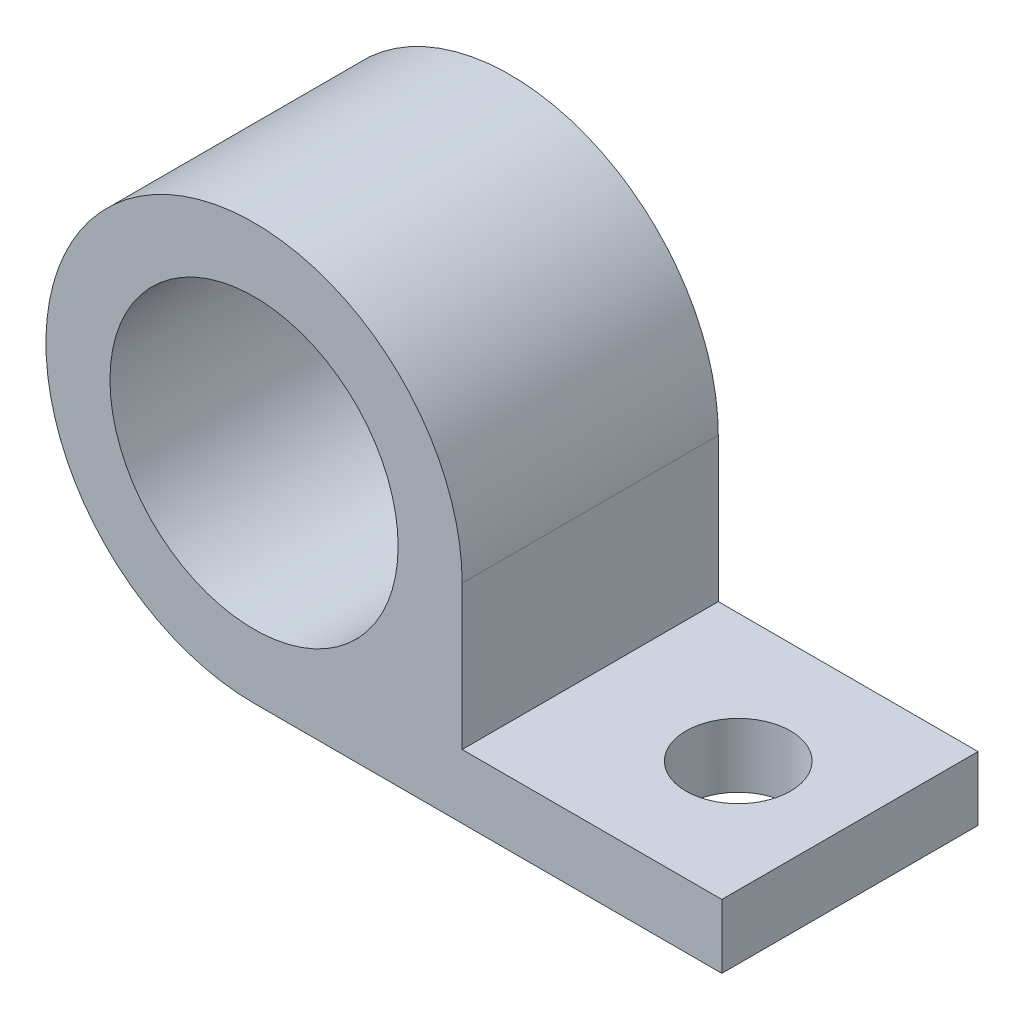
ISO-10303-21;
HEADER;
FILE_DESCRIPTION(('STEP AP214'),'2;1');
FILE_NAME('part.step','',(''),(''),'','','');
FILE_SCHEMA(('AUTOMOTIVE_DESIGN { 1 0 10303 214 1 1 1 1 }'));
ENDSEC;
DATA;
#1=APPLICATION_CONTEXT('core data for automotive mechanical design processes');
#2=APPLICATION_PROTOCOL_DEFINITION('international standard','automotive_design',2000,#1);
#3=PRODUCT_CONTEXT('',#1,'mechanical');
#4=PRODUCT('Part','Part','',(#3));
#5=PRODUCT_RELATED_PRODUCT_CATEGORY('part','',(#4));
#6=PRODUCT_DEFINITION_FORMATION('','',#4);
#7=PRODUCT_DEFINITION_CONTEXT('part definition',#1,'design');
#8=PRODUCT_DEFINITION('design','',#6,#7);
#9=PRODUCT_DEFINITION_SHAPE('','',#8);
#10=(LENGTH_UNIT() NAMED_UNIT(*) SI_UNIT(.MILLI.,.METRE.));
#11=(NAMED_UNIT(*) PLANE_ANGLE_UNIT() SI_UNIT($,.RADIAN.));
#12=(NAMED_UNIT(*) SI_UNIT($,.STERADIAN.) SOLID_ANGLE_UNIT());
#13=UNCERTAINTY_MEASURE_WITH_UNIT(LENGTH_MEASURE(1.E-05),#10,'distance_accuracy_value','');
#14=(GEOMETRIC_REPRESENTATION_CONTEXT(3) GLOBAL_UNCERTAINTY_ASSIGNED_CONTEXT((#13)) GLOBAL_UNIT_ASSIGNED_CONTEXT((#10,
#11,#12)) REPRESENTATION_CONTEXT('',''));
#15=CARTESIAN_POINT('',(0.,0.,0.));
#16=DIRECTION('',(0.,0.,1.));
#17=DIRECTION('',(1.,0.,0.));
#18=AXIS2_PLACEMENT_3D('',#15,#16,#17);
#19=CARTESIAN_POINT('',(0.,0.,6.35));
#20=DIRECTION('',(0.,0.,1.));
#21=DIRECTION('',(1.,0.,0.));
#22=AXIS2_PLACEMENT_3D('',#19,#20,#21);
#23=PLANE('',#22);
#24=CARTESIAN_POINT('',(0.,0.,6.35));
#25=DIRECTION('',(0.,0.,1.));
#26=DIRECTION('',(1.,0.,0.));
#27=AXIS2_PLACEMENT_3D('',#24,#25,#26);
#28=CIRCLE('',#27,10.31875);
#29=CARTESIAN_POINT('',(10.31875,0.,6.35));
#30=VERTEX_POINT('',#29);
#31=CARTESIAN_POINT('',(0.,-10.31875,6.35));
#32=VERTEX_POINT('',#31);
#33=EDGE_CURVE('E118',#30,#32,#28,.T.);
#34=ORIENTED_EDGE('',*,*,#33,.T.);
#35=DIRECTION('',(1.,0.,0.));
#36=VECTOR('',#35,1.);
#37=CARTESIAN_POINT('',(0.,-10.31875,6.35));
#38=LINE('',#37,#36);
#39=CARTESIAN_POINT('',(23.19528,-10.31875,6.35));
#40=VERTEX_POINT('',#39);
#41=EDGE_CURVE('E85',#32,#40,#38,.T.);
#42=ORIENTED_EDGE('',*,*,#41,.T.);
#43=DIRECTION('',(0.,1.,0.));
#44=VECTOR('',#43,1.);
#45=CARTESIAN_POINT('',(23.19528,-10.31875,6.35));
#46=LINE('',#45,#44);
#47=CARTESIAN_POINT('',(23.19528,-7.14374999999999,6.35));
#48=VERTEX_POINT('',#47);
#49=EDGE_CURVE('E89',#40,#48,#46,.T.);
#50=ORIENTED_EDGE('',*,*,#49,.T.);
#51=DIRECTION('',(-1.,0.,0.));
#52=VECTOR('',#51,1.);
#53=CARTESIAN_POINT('',(23.19528,-7.14374999999999,6.35));
#54=LINE('',#53,#52);
#55=CARTESIAN_POINT('',(10.31875,-7.14375,6.35));
#56=VERTEX_POINT('',#55);
#57=EDGE_CURVE('E93',#48,#56,#54,.T.);
#58=ORIENTED_EDGE('',*,*,#57,.T.);
#59=DIRECTION('',(0.,1.,0.));
#60=VECTOR('',#59,1.);
#61=CARTESIAN_POINT('',(10.31875,-7.14375,6.35));
#62=LINE('',#61,#60);
#63=EDGE_CURVE('E51',#56,#30,#62,.T.);
#64=ORIENTED_EDGE('',*,*,#63,.T.);
#65=EDGE_LOOP('',(#34,#42,#50,#58,#64));
#66=FACE_BOUND('',#65,.T.);
#67=CARTESIAN_POINT('',(0.,0.,6.35));
#68=DIRECTION('',(0.,0.,1.));
#69=DIRECTION('',(1.,0.,0.));
#70=AXIS2_PLACEMENT_3D('',#67,#68,#69);
#71=CIRCLE('',#70,7.14375);
#72=CARTESIAN_POINT('',(7.14375,0.,6.35));
#73=VERTEX_POINT('',#72);
#74=EDGE_CURVE('E113',#73,#73,#71,.T.);
#75=ORIENTED_EDGE('',*,*,#74,.F.);
#76=EDGE_LOOP('',(#75));
#77=FACE_BOUND('',#76,.T.);
#78=ADVANCED_FACE('F33',(#66,#77),#23,.T.);
#79=CARTESIAN_POINT('',(0.,0.,-6.35));
#80=DIRECTION('',(0.,0.,1.));
#81=DIRECTION('',(1.,0.,0.));
#82=AXIS2_PLACEMENT_3D('',#79,#80,#81);
#83=PLANE('',#82);
#84=CARTESIAN_POINT('',(0.,0.,-6.35));
#85=DIRECTION('',(0.,0.,1.));
#86=DIRECTION('',(1.,0.,0.));
#87=AXIS2_PLACEMENT_3D('',#84,#85,#86);
#88=CIRCLE('',#87,10.31875);
#89=CARTESIAN_POINT('',(10.31875,0.,-6.35));
#90=VERTEX_POINT('',#89);
#91=CARTESIAN_POINT('',(0.,-10.31875,-6.35));
#92=VERTEX_POINT('',#91);
#93=EDGE_CURVE('E109',#90,#92,#88,.T.);
#94=ORIENTED_EDGE('',*,*,#93,.F.);
#95=DIRECTION('',(0.,1.,0.));
#96=VECTOR('',#95,1.);
#97=CARTESIAN_POINT('',(10.31875,-7.14375,-6.35));
#98=LINE('',#97,#96);
#99=CARTESIAN_POINT('',(10.31875,-7.14375,-6.35));
#100=VERTEX_POINT('',#99);
#101=EDGE_CURVE('E77',#100,#90,#98,.T.);
#102=ORIENTED_EDGE('',*,*,#101,.F.);
#103=DIRECTION('',(-1.,0.,0.));
#104=VECTOR('',#103,1.);
#105=CARTESIAN_POINT('',(23.19528,-7.14374999999999,-6.35));
#106=LINE('',#105,#104);
#107=CARTESIAN_POINT('',(23.19528,-7.14374999999999,-6.35));
#108=VERTEX_POINT('',#107);
#109=EDGE_CURVE('E71',#108,#100,#106,.T.);
#110=ORIENTED_EDGE('',*,*,#109,.F.);
#111=DIRECTION('',(0.,1.,0.));
#112=VECTOR('',#111,1.);
#113=CARTESIAN_POINT('',(23.19528,-10.31875,-6.35));
#114=LINE('',#113,#112);
#115=CARTESIAN_POINT('',(23.19528,-10.31875,-6.35));
#116=VERTEX_POINT('',#115);
#117=EDGE_CURVE('E100',#116,#108,#114,.T.);
#118=ORIENTED_EDGE('',*,*,#117,.F.);
#119=DIRECTION('',(1.,0.,0.));
#120=VECTOR('',#119,1.);
#121=CARTESIAN_POINT('',(0.,-10.31875,-6.35));
#122=LINE('',#121,#120);
#123=EDGE_CURVE('E112',#92,#116,#122,.T.);
#124=ORIENTED_EDGE('',*,*,#123,.F.);
#125=EDGE_LOOP('',(#94,#102,#110,#118,#124));
#126=FACE_BOUND('',#125,.T.);
#127=CARTESIAN_POINT('',(0.,0.,-6.35));
#128=DIRECTION('',(0.,0.,1.));
#129=DIRECTION('',(1.,0.,0.));
#130=AXIS2_PLACEMENT_3D('',#127,#128,#129);
#131=CIRCLE('',#130,7.14375);
#132=CARTESIAN_POINT('',(7.14375,0.,-6.35));
#133=VERTEX_POINT('',#132);
#134=EDGE_CURVE('E158',#133,#133,#131,.T.);
#135=ORIENTED_EDGE('',*,*,#134,.T.);
#136=EDGE_LOOP('',(#135));
#137=FACE_BOUND('',#136,.T.);
#138=ADVANCED_FACE('F123',(#126,#137),#83,.F.);
#139=CARTESIAN_POINT('',(0.,0.,6.35));
#140=DIRECTION('',(0.,0.,-1.));
#141=DIRECTION('',(-1.,0.,0.));
#142=AXIS2_PLACEMENT_3D('',#139,#140,#141);
#143=CYLINDRICAL_SURFACE('',#142,10.31875);
#144=ORIENTED_EDGE('',*,*,#93,.T.);
#145=DIRECTION('',(0.,0.,-1.));
#146=VECTOR('',#145,1.);
#147=CARTESIAN_POINT('',(0.,-10.31875,6.35));
#148=LINE('',#147,#146);
#149=EDGE_CURVE('E11',#32,#92,#148,.T.);
#150=ORIENTED_EDGE('',*,*,#149,.F.);
#151=ORIENTED_EDGE('',*,*,#33,.F.);
#152=DIRECTION('',(0.,0.,-1.));
#153=VECTOR('',#152,1.);
#154=CARTESIAN_POINT('',(10.31875,0.,6.35));
#155=LINE('',#154,#153);
#156=EDGE_CURVE('E105',#30,#90,#155,.T.);
#157=ORIENTED_EDGE('',*,*,#156,.T.);
#158=EDGE_LOOP('',(#144,#150,#151,#157));
#159=FACE_BOUND('',#158,.T.);
#160=ADVANCED_FACE('F35',(#159),#143,.T.);
#161=CARTESIAN_POINT('',(0.,-10.31875,6.35));
#162=DIRECTION('',(0.,1.,0.));
#163=DIRECTION('',(-1.,0.,0.));
#164=AXIS2_PLACEMENT_3D('',#161,#162,#163);
#165=PLANE('',#164);
#166=CARTESIAN_POINT('',(17.65808,-10.31875,0.));
#167=DIRECTION('',(0.,1.,0.));
#168=DIRECTION('',(0.,0.,1.));
#169=AXIS2_PLACEMENT_3D('',#166,#167,#168);
#170=CIRCLE('',#169,2.59079999999999);
#171=CARTESIAN_POINT('',(17.65808,-10.31875,2.59079999999999));
#172=VERTEX_POINT('',#171);
#173=EDGE_CURVE('E155',#172,#172,#170,.T.);
#174=ORIENTED_EDGE('',*,*,#173,.T.);
#175=EDGE_LOOP('',(#174));
#176=FACE_BOUND('',#175,.T.);
#177=ORIENTED_EDGE('',*,*,#123,.T.);
#178=DIRECTION('',(0.,0.,-1.));
#179=VECTOR('',#178,1.);
#180=CARTESIAN_POINT('',(23.19528,-10.31875,6.35));
#181=LINE('',#180,#179);
#182=EDGE_CURVE('E43',#40,#116,#181,.T.);
#183=ORIENTED_EDGE('',*,*,#182,.F.);
#184=ORIENTED_EDGE('',*,*,#41,.F.);
#185=ORIENTED_EDGE('',*,*,#149,.T.);
#186=EDGE_LOOP('',(#177,#183,#184,#185));
#187=FACE_BOUND('',#186,.T.);
#188=ADVANCED_FACE('F169',(#176,#187),#165,.F.);
#189=CARTESIAN_POINT('',(23.19528,-10.31875,6.35));
#190=DIRECTION('',(-1.,0.,0.));
#191=DIRECTION('',(0.,0.,1.));
#192=AXIS2_PLACEMENT_3D('',#189,#190,#191);
#193=PLANE('',#192);
#194=ORIENTED_EDGE('',*,*,#117,.T.);
#195=DIRECTION('',(0.,0.,-1.));
#196=VECTOR('',#195,1.);
#197=CARTESIAN_POINT('',(23.19528,-7.14374999999999,6.35));
#198=LINE('',#197,#196);
#199=EDGE_CURVE('E97',#48,#108,#198,.T.);
#200=ORIENTED_EDGE('',*,*,#199,.F.);
#201=ORIENTED_EDGE('',*,*,#49,.F.);
#202=ORIENTED_EDGE('',*,*,#182,.T.);
#203=EDGE_LOOP('',(#194,#200,#201,#202));
#204=FACE_BOUND('',#203,.T.);
#205=ADVANCED_FACE('F98',(#204),#193,.F.);
#206=CARTESIAN_POINT('',(23.19528,-7.14374999999999,6.35));
#207=DIRECTION('',(0.,-1.,0.));
#208=DIRECTION('',(1.,0.,0.));
#209=AXIS2_PLACEMENT_3D('',#206,#207,#208);
#210=PLANE('',#209);
#211=CARTESIAN_POINT('',(17.65808,-7.14374999999999,0.));
#212=DIRECTION('',(0.,-1.,0.));
#213=DIRECTION('',(1.,0.,0.));
#214=AXIS2_PLACEMENT_3D('',#211,#212,#213);
#215=CIRCLE('',#214,2.59079999999999);
#216=CARTESIAN_POINT('',(20.24888,-7.14374999999999,0.));
#217=VERTEX_POINT('',#216);
#218=EDGE_CURVE('E37',#217,#217,#215,.T.);
#219=ORIENTED_EDGE('',*,*,#218,.T.);
#220=EDGE_LOOP('',(#219));
#221=FACE_BOUND('',#220,.T.);
#222=ORIENTED_EDGE('',*,*,#109,.T.);
#223=DIRECTION('',(0.,0.,-1.));
#224=VECTOR('',#223,1.);
#225=CARTESIAN_POINT('',(10.31875,-7.14375,6.35));
#226=LINE('',#225,#224);
#227=EDGE_CURVE('E101',#56,#100,#226,.T.);
#228=ORIENTED_EDGE('',*,*,#227,.F.);
#229=ORIENTED_EDGE('',*,*,#57,.F.);
#230=ORIENTED_EDGE('',*,*,#199,.T.);
#231=EDGE_LOOP('',(#222,#228,#229,#230));
#232=FACE_BOUND('',#231,.T.);
#233=ADVANCED_FACE('F103',(#221,#232),#210,.F.);
#234=CARTESIAN_POINT('',(10.31875,-7.14375,6.35));
#235=DIRECTION('',(-1.,0.,0.));
#236=DIRECTION('',(0.,0.,1.));
#237=AXIS2_PLACEMENT_3D('',#234,#235,#236);
#238=PLANE('',#237);
#239=ORIENTED_EDGE('',*,*,#101,.T.);
#240=ORIENTED_EDGE('',*,*,#156,.F.);
#241=ORIENTED_EDGE('',*,*,#63,.F.);
#242=ORIENTED_EDGE('',*,*,#227,.T.);
#243=EDGE_LOOP('',(#239,#240,#241,#242));
#244=FACE_BOUND('',#243,.T.);
#245=ADVANCED_FACE('F128',(#244),#238,.F.);
#246=CARTESIAN_POINT('',(0.,0.,6.35));
#247=DIRECTION('',(0.,0.,-1.));
#248=DIRECTION('',(-1.,0.,0.));
#249=AXIS2_PLACEMENT_3D('',#246,#247,#248);
#250=CYLINDRICAL_SURFACE('',#249,7.14375);
#251=ORIENTED_EDGE('',*,*,#74,.T.);
#252=EDGE_LOOP('',(#251));
#253=FACE_BOUND('',#252,.T.);
#254=ORIENTED_EDGE('',*,*,#134,.F.);
#255=EDGE_LOOP('',(#254));
#256=FACE_BOUND('',#255,.T.);
#257=ADVANCED_FACE('F130',(#253,#256),#250,.F.);
#258=CARTESIAN_POINT('',(17.65808,-10.31875,0.));
#259=DIRECTION('',(0.,1.,0.));
#260=DIRECTION('',(0.,0.,1.));
#261=AXIS2_PLACEMENT_3D('',#258,#259,#260);
#262=CYLINDRICAL_SURFACE('',#261,2.59079999999999);
#263=ORIENTED_EDGE('',*,*,#173,.F.);
#264=EDGE_LOOP('',(#263));
#265=FACE_BOUND('',#264,.T.);
#266=ORIENTED_EDGE('',*,*,#218,.F.);
#267=EDGE_LOOP('',(#266));
#268=FACE_BOUND('',#267,.T.);
#269=ADVANCED_FACE('F136',(#265,#268),#262,.F.);
#270=CLOSED_SHELL('',(#78,#138,#160,#188,#205,#233,#245,#257,#269));
#271=MANIFOLD_SOLID_BREP('B2',#270);
#272=ADVANCED_BREP_SHAPE_REPRESENTATION('',(#18,#271),#14);
#273=SHAPE_DEFINITION_REPRESENTATION(#9,#272);
ENDSEC;
END-ISO-10303-21;
